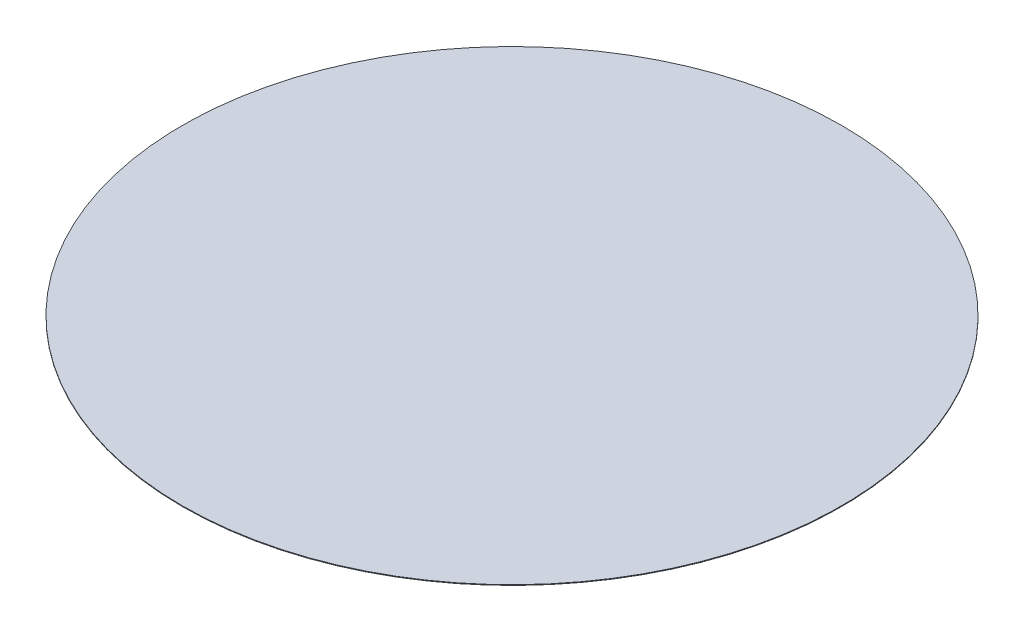
ISO-10303-21;
HEADER;
FILE_DESCRIPTION(('STEP AP214'),'2;1');
FILE_NAME('part.step','',(''),(''),'','','');
FILE_SCHEMA(('AUTOMOTIVE_DESIGN { 1 0 10303 214 1 1 1 1 }'));
ENDSEC;
DATA;
#1=APPLICATION_CONTEXT('core data for automotive mechanical design processes');
#2=APPLICATION_PROTOCOL_DEFINITION('international standard','automotive_design',2000,#1);
#3=PRODUCT_CONTEXT('',#1,'mechanical');
#4=PRODUCT('Part','Part','',(#3));
#5=PRODUCT_RELATED_PRODUCT_CATEGORY('part','',(#4));
#6=PRODUCT_DEFINITION_FORMATION('','',#4);
#7=PRODUCT_DEFINITION_CONTEXT('part definition',#1,'design');
#8=PRODUCT_DEFINITION('design','',#6,#7);
#9=PRODUCT_DEFINITION_SHAPE('','',#8);
#10=(LENGTH_UNIT() NAMED_UNIT(*) SI_UNIT(.MILLI.,.METRE.));
#11=(NAMED_UNIT(*) PLANE_ANGLE_UNIT() SI_UNIT($,.RADIAN.));
#12=(NAMED_UNIT(*) SI_UNIT($,.STERADIAN.) SOLID_ANGLE_UNIT());
#13=UNCERTAINTY_MEASURE_WITH_UNIT(LENGTH_MEASURE(1.E-05),#10,'distance_accuracy_value','');
#14=(GEOMETRIC_REPRESENTATION_CONTEXT(3) GLOBAL_UNCERTAINTY_ASSIGNED_CONTEXT((#13)) GLOBAL_UNIT_ASSIGNED_CONTEXT((#10,
#11,#12)) REPRESENTATION_CONTEXT('',''));
#15=CARTESIAN_POINT('',(0.,0.,0.));
#16=DIRECTION('',(0.,0.,1.));
#17=DIRECTION('',(1.,0.,0.));
#18=AXIS2_PLACEMENT_3D('',#15,#16,#17);
#19=CARTESIAN_POINT('',(0.,5.,0.));
#20=DIRECTION('',(0.,-1.,0.));
#21=DIRECTION('',(0.,0.,-1.));
#22=AXIS2_PLACEMENT_3D('',#19,#20,#21);
#23=CYLINDRICAL_SURFACE('',#22,2440.);
#24=CARTESIAN_POINT('',(0.,5.,0.));
#25=DIRECTION('',(0.,1.,0.));
#26=DIRECTION('',(0.,0.,1.));
#27=AXIS2_PLACEMENT_3D('',#24,#25,#26);
#28=CIRCLE('',#27,2440.);
#29=CARTESIAN_POINT('',(0.,5.,2440.));
#30=VERTEX_POINT('',#29);
#31=EDGE_CURVE('E10',#30,#30,#28,.T.);
#32=ORIENTED_EDGE('',*,*,#31,.F.);
#33=EDGE_LOOP('',(#32));
#34=FACE_BOUND('',#33,.T.);
#35=CARTESIAN_POINT('',(0.,0.,0.));
#36=DIRECTION('',(0.,1.,0.));
#37=DIRECTION('',(0.,0.,1.));
#38=AXIS2_PLACEMENT_3D('',#35,#36,#37);
#39=CIRCLE('',#38,2440.);
#40=CARTESIAN_POINT('',(0.,0.,2440.));
#41=VERTEX_POINT('',#40);
#42=EDGE_CURVE('E34',#41,#41,#39,.T.);
#43=ORIENTED_EDGE('',*,*,#42,.T.);
#44=EDGE_LOOP('',(#43));
#45=FACE_BOUND('',#44,.T.);
#46=ADVANCED_FACE('F31',(#34,#45),#23,.T.);
#47=CARTESIAN_POINT('',(0.,5.,0.));
#48=DIRECTION('',(0.,1.,0.));
#49=DIRECTION('',(0.,0.,1.));
#50=AXIS2_PLACEMENT_3D('',#47,#48,#49);
#51=PLANE('',#50);
#52=ORIENTED_EDGE('',*,*,#31,.T.);
#53=EDGE_LOOP('',(#52));
#54=FACE_BOUND('',#53,.T.);
#55=ADVANCED_FACE('F46',(#54),#51,.T.);
#56=CARTESIAN_POINT('',(0.,0.,0.));
#57=DIRECTION('',(0.,1.,0.));
#58=DIRECTION('',(0.,0.,1.));
#59=AXIS2_PLACEMENT_3D('',#56,#57,#58);
#60=PLANE('',#59);
#61=ORIENTED_EDGE('',*,*,#42,.F.);
#62=EDGE_LOOP('',(#61));
#63=FACE_BOUND('',#62,.T.);
#64=ADVANCED_FACE('F44',(#63),#60,.F.);
#65=CLOSED_SHELL('',(#46,#55,#64));
#66=MANIFOLD_SOLID_BREP('B2',#65);
#67=ADVANCED_BREP_SHAPE_REPRESENTATION('',(#18,#66),#14);
#68=SHAPE_DEFINITION_REPRESENTATION(#9,#67);
ENDSEC;
END-ISO-10303-21;
